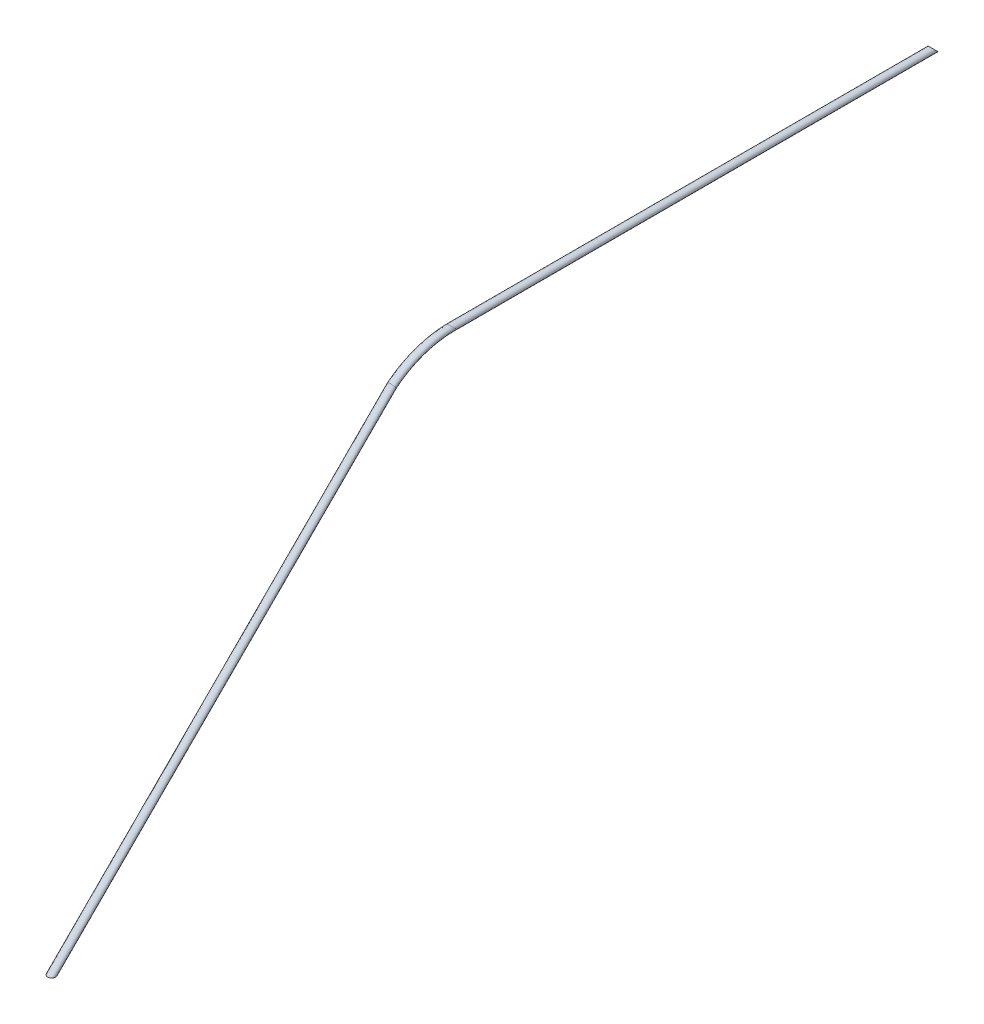
ISO-10303-21;
HEADER;
FILE_DESCRIPTION(('STEP AP214'),'2;1');
FILE_NAME('part.step','',(''),(''),'','','');
FILE_SCHEMA(('AUTOMOTIVE_DESIGN { 1 0 10303 214 1 1 1 1 }'));
ENDSEC;
DATA;
#1=APPLICATION_CONTEXT('core data for automotive mechanical design processes');
#2=APPLICATION_PROTOCOL_DEFINITION('international standard','automotive_design',2000,#1);
#3=PRODUCT_CONTEXT('',#1,'mechanical');
#4=PRODUCT('Part','Part','',(#3));
#5=PRODUCT_RELATED_PRODUCT_CATEGORY('part','',(#4));
#6=PRODUCT_DEFINITION_FORMATION('','',#4);
#7=PRODUCT_DEFINITION_CONTEXT('part definition',#1,'design');
#8=PRODUCT_DEFINITION('design','',#6,#7);
#9=PRODUCT_DEFINITION_SHAPE('','',#8);
#10=(LENGTH_UNIT() NAMED_UNIT(*) SI_UNIT(.MILLI.,.METRE.));
#11=(NAMED_UNIT(*) PLANE_ANGLE_UNIT() SI_UNIT($,.RADIAN.));
#12=(NAMED_UNIT(*) SI_UNIT($,.STERADIAN.) SOLID_ANGLE_UNIT());
#13=UNCERTAINTY_MEASURE_WITH_UNIT(LENGTH_MEASURE(1.E-05),#10,'distance_accuracy_value','');
#14=(GEOMETRIC_REPRESENTATION_CONTEXT(3) GLOBAL_UNCERTAINTY_ASSIGNED_CONTEXT((#13)) GLOBAL_UNIT_ASSIGNED_CONTEXT((#10,
#11,#12)) REPRESENTATION_CONTEXT('',''));
#15=CARTESIAN_POINT('',(0.,0.,0.));
#16=DIRECTION('',(0.,0.,1.));
#17=DIRECTION('',(1.,0.,0.));
#18=AXIS2_PLACEMENT_3D('',#15,#16,#17);
#19=CARTESIAN_POINT('',(0.,112.564494546636,-274.712154418931));
#20=DIRECTION('',(0.,0.707106781186546,-0.707106781186549));
#21=DIRECTION('',(0.,0.707106781186549,0.707106781186546));
#22=AXIS2_PLACEMENT_3D('',#19,#20,#21);
#23=PLANE('',#22);
#24=CARTESIAN_POINT('',(0.,112.564494546636,-274.712154418931));
#25=DIRECTION('',(0.,0.707106781186546,-0.707106781186549));
#26=DIRECTION('',(0.,0.707106781186549,0.707106781186546));
#27=AXIS2_PLACEMENT_3D('',#24,#25,#26);
#28=CIRCLE('',#27,1.25);
#29=CARTESIAN_POINT('',(0.,113.448378023119,-273.828270942448));
#30=VERTEX_POINT('',#29);
#31=EDGE_CURVE('E38',#30,#30,#28,.T.);
#32=ORIENTED_EDGE('',*,*,#31,.T.);
#33=EDGE_LOOP('',(#32));
#34=FACE_BOUND('',#33,.T.);
#35=ADVANCED_FACE('F35',(#34),#23,.T.);
#36=CARTESIAN_POINT('',(0.,0.,0.));
#37=DIRECTION('',(0.,1.,0.));
#38=DIRECTION('',(0.,0.,1.));
#39=AXIS2_PLACEMENT_3D('',#36,#37,#38);
#40=PLANE('',#39);
#41=CARTESIAN_POINT('',(0.,0.,0.));
#42=DIRECTION('',(0.,1.,0.));
#43=DIRECTION('',(0.,0.,1.));
#44=AXIS2_PLACEMENT_3D('',#41,#42,#43);
#45=CIRCLE('',#44,1.25);
#46=CARTESIAN_POINT('',(0.,0.,1.25));
#47=VERTEX_POINT('',#46);
#48=EDGE_CURVE('E55',#47,#47,#45,.T.);
#49=ORIENTED_EDGE('',*,*,#48,.F.);
#50=EDGE_LOOP('',(#49));
#51=FACE_BOUND('',#50,.T.);
#52=ADVANCED_FACE('F111',(#51),#40,.F.);
#53=CARTESIAN_POINT('',(0.,105.577305752246,-104.027956080632));
#54=CARTESIAN_POINT('',(0.,105.787893948815,-104.293380667153));
#55=CARTESIAN_POINT('',(0.,105.99147204465,-104.557995570937));
#56=CARTESIAN_POINT('',(0.,106.747553293268,-105.483070542752));
#57=CARTESIAN_POINT('',(0.,107.292985696413,-106.169156479261));
#58=CARTESIAN_POINT('',(0.,108.290000005037,-107.5791623847));
#59=CARTESIAN_POINT('',(0.,108.758934755658,-108.305072615006));
#60=CARTESIAN_POINT('',(0.,110.072077272006,-110.537864610288));
#61=CARTESIAN_POINT('',(0.,110.822354029564,-112.099820584772));
#62=CARTESIAN_POINT('',(0.,112.05182056666,-115.327316035152));
#63=CARTESIAN_POINT('',(0.,112.530927374933,-116.992656518133));
#64=CARTESIAN_POINT('',(0.,113.036127258252,-119.533287032788));
#65=CARTESIAN_POINT('',(0.,113.169003969863,-120.387223912541));
#66=CARTESIAN_POINT('',(0.,113.362778050406,-122.103178730383));
#67=CARTESIAN_POINT('',(0.,113.436027513086,-122.97754001041));
#68=CARTESIAN_POINT('',(0.,113.448378023119,-123.828270942448));
#69=CARTESIAN_POINT('',(2.49999999999999,105.577305752246,-104.027956080632));
#70=CARTESIAN_POINT('',(2.49999999999999,105.787893948815,-104.293380667153));
#71=CARTESIAN_POINT('',(2.49999999999999,105.99147204465,-104.557995570937));
#72=CARTESIAN_POINT('',(2.49999999999999,106.747553293268,-105.483070542752));
#73=CARTESIAN_POINT('',(2.49999999999999,107.292985696413,-106.169156479261));
#74=CARTESIAN_POINT('',(2.49999999999999,108.290000005037,-107.5791623847));
#75=CARTESIAN_POINT('',(2.49999999999999,108.758934755658,-108.305072615006));
#76=CARTESIAN_POINT('',(2.49999999999999,110.072077272006,-110.537864610288));
#77=CARTESIAN_POINT('',(2.49999999999999,110.822354029564,-112.099820584772));
#78=CARTESIAN_POINT('',(2.49999999999999,112.05182056666,-115.327316035152));
#79=CARTESIAN_POINT('',(2.49999999999999,112.530927374933,-116.992656518133));
#80=CARTESIAN_POINT('',(2.49999999999999,113.036127258252,-119.533287032788));
#81=CARTESIAN_POINT('',(2.49999999999999,113.169003969863,-120.387223912541));
#82=CARTESIAN_POINT('',(2.49999999999999,113.362778050406,-122.103178730383));
#83=CARTESIAN_POINT('',(2.49999999999999,113.436027513086,-122.97754001041));
#84=CARTESIAN_POINT('',(2.49999999999999,113.448378023119,-123.828270942448));
#85=CARTESIAN_POINT('',(2.49999999999999,105.291199424344,-106.511530756202));
#86=CARTESIAN_POINT('',(2.49999999999999,105.501787620913,-106.776955342724));
#87=CARTESIAN_POINT('',(2.49999999999999,105.71939035038,-107.043186112822));
#88=CARTESIAN_POINT('',(2.49999999999999,106.426740691447,-107.962646490056));
#89=CARTESIAN_POINT('',(2.49999999999999,106.868395547251,-108.633827745709));
#90=CARTESIAN_POINT('',(2.49999999999999,107.728422836529,-110.016273857374));
#91=CARTESIAN_POINT('',(2.49999999999999,108.129442282032,-110.725531325174));
#92=CARTESIAN_POINT('',(2.49999999999999,109.241289962979,-112.8999224028));
#93=CARTESIAN_POINT('',(2.49999999999999,109.860653394342,-114.411671873198));
#94=CARTESIAN_POINT('',(2.49999999999999,110.838486455123,-117.517600223407));
#95=CARTESIAN_POINT('',(2.49999999999999,111.196889049572,-119.111587207401));
#96=CARTESIAN_POINT('',(2.49999999999999,111.531222531544,-121.530821298671));
#97=CARTESIAN_POINT('',(2.49999999999999,111.608841353382,-122.341903856913));
#98=CARTESIAN_POINT('',(2.49999999999999,111.695885188338,-123.967675783528));
#99=CARTESIAN_POINT('',(2.49999999999999,111.692961580186,-124.770007983444));
#100=CARTESIAN_POINT('',(2.49999999999999,111.680611070153,-125.596037895415));
#101=CARTESIAN_POINT('',(0.,105.291199424344,-106.511530756202));
#102=CARTESIAN_POINT('',(0.,105.501787620913,-106.776955342724));
#103=CARTESIAN_POINT('',(0.,105.71939035038,-107.043186112822));
#104=CARTESIAN_POINT('',(0.,106.426740691447,-107.962646490056));
#105=CARTESIAN_POINT('',(0.,106.868395547251,-108.633827745712));
#106=CARTESIAN_POINT('',(0.,107.728422836529,-110.016273857371));
#107=CARTESIAN_POINT('',(0.,108.129442282032,-110.725531325174));
#108=CARTESIAN_POINT('',(0.,109.241289962979,-112.8999224028));
#109=CARTESIAN_POINT('',(0.,109.860653394342,-114.411671873198));
#110=CARTESIAN_POINT('',(0.,110.838486455123,-117.517600223407));
#111=CARTESIAN_POINT('',(0.,111.196889049572,-119.111587207401));
#112=CARTESIAN_POINT('',(0.,111.531222531544,-121.530821298671));
#113=CARTESIAN_POINT('',(0.,111.608841353382,-122.341903856913));
#114=CARTESIAN_POINT('',(0.,111.695885188338,-123.967675783528));
#115=CARTESIAN_POINT('',(0.,111.692961580186,-124.770007983444));
#116=CARTESIAN_POINT('',(0.,111.680611070153,-125.596037895415));
#117=CARTESIAN_POINT('',(-2.50000000000001,105.291199424344,-106.511530756202));
#118=CARTESIAN_POINT('',(-2.50000000000001,105.501787620913,-106.776955342724));
#119=CARTESIAN_POINT('',(-2.50000000000001,105.71939035038,-107.043186112822));
#120=CARTESIAN_POINT('',(-2.50000000000001,106.426740691447,-107.962646490056));
#121=CARTESIAN_POINT('',(-2.50000000000001,106.868395547251,-108.633827745715));
#122=CARTESIAN_POINT('',(-2.50000000000001,107.728422836529,-110.016273857368));
#123=CARTESIAN_POINT('',(-2.50000000000001,108.129442282032,-110.725531325174));
#124=CARTESIAN_POINT('',(-2.50000000000001,109.241289962979,-112.8999224028));
#125=CARTESIAN_POINT('',(-2.50000000000001,109.860653394342,-114.411671873198));
#126=CARTESIAN_POINT('',(-2.50000000000001,110.838486455123,-117.517600223407));
#127=CARTESIAN_POINT('',(-2.50000000000001,111.196889049572,-119.111587207401));
#128=CARTESIAN_POINT('',(-2.50000000000001,111.531222531544,-121.530821298671));
#129=CARTESIAN_POINT('',(-2.50000000000001,111.608841353382,-122.341903856913));
#130=CARTESIAN_POINT('',(-2.50000000000001,111.695885188338,-123.967675783528));
#131=CARTESIAN_POINT('',(-2.50000000000001,111.692961580186,-124.770007983444));
#132=CARTESIAN_POINT('',(-2.50000000000001,111.680611070153,-125.596037895415));
#133=CARTESIAN_POINT('',(-2.50000000000001,105.577305752246,-104.027956080632));
#134=CARTESIAN_POINT('',(-2.50000000000001,105.787893948815,-104.293380667153));
#135=CARTESIAN_POINT('',(-2.50000000000001,105.99147204465,-104.557995570937));
#136=CARTESIAN_POINT('',(-2.50000000000001,106.747553293268,-105.483070542752));
#137=CARTESIAN_POINT('',(-2.50000000000001,107.292985696413,-106.169156479261));
#138=CARTESIAN_POINT('',(-2.50000000000001,108.290000005037,-107.5791623847));
#139=CARTESIAN_POINT('',(-2.50000000000001,108.758934755658,-108.305072615006));
#140=CARTESIAN_POINT('',(-2.50000000000001,110.072077272006,-110.537864610288));
#141=CARTESIAN_POINT('',(-2.50000000000001,110.822354029564,-112.099820584772));
#142=CARTESIAN_POINT('',(-2.50000000000001,112.05182056666,-115.327316035152));
#143=CARTESIAN_POINT('',(-2.50000000000001,112.530927374933,-116.992656518133));
#144=CARTESIAN_POINT('',(-2.50000000000001,113.036127258252,-119.533287032788));
#145=CARTESIAN_POINT('',(-2.50000000000001,113.169003969863,-120.387223912541));
#146=CARTESIAN_POINT('',(-2.50000000000001,113.362778050406,-122.103178730383));
#147=CARTESIAN_POINT('',(-2.50000000000001,113.436027513086,-122.97754001041));
#148=CARTESIAN_POINT('',(-2.50000000000001,113.448378023119,-123.828270942448));
#149=CARTESIAN_POINT('',(0.,105.577305752246,-104.027956080632));
#150=CARTESIAN_POINT('',(0.,105.787893948815,-104.293380667153));
#151=CARTESIAN_POINT('',(0.,105.99147204465,-104.557995570937));
#152=CARTESIAN_POINT('',(0.,106.747553293268,-105.483070542752));
#153=CARTESIAN_POINT('',(0.,107.292985696413,-106.169156479261));
#154=CARTESIAN_POINT('',(0.,108.290000005037,-107.5791623847));
#155=CARTESIAN_POINT('',(0.,108.758934755658,-108.305072615006));
#156=CARTESIAN_POINT('',(0.,110.072077272006,-110.537864610288));
#157=CARTESIAN_POINT('',(0.,110.822354029564,-112.099820584772));
#158=CARTESIAN_POINT('',(0.,112.05182056666,-115.327316035152));
#159=CARTESIAN_POINT('',(0.,112.530927374933,-116.992656518133));
#160=CARTESIAN_POINT('',(0.,113.036127258252,-119.533287032788));
#161=CARTESIAN_POINT('',(0.,113.169003969863,-120.387223912541));
#162=CARTESIAN_POINT('',(0.,113.362778050406,-122.103178730383));
#163=CARTESIAN_POINT('',(0.,113.436027513086,-122.97754001041));
#164=CARTESIAN_POINT('',(0.,113.448378023119,-123.828270942448));
#165=(BOUNDED_SURFACE() B_SPLINE_SURFACE(3,3,((#53,#54,#55,#56,#57,#58,#59,#60,#61,#62,#63,#64,
#65,#66,#67,#68),(#69,#70,#71,#72,#73,#74,#75,#76,#77,#78,#79,#80,#81,#82,#83,#84),(#85,#86,#87,
#88,#89,#90,#91,#92,#93,#94,#95,#96,#97,#98,#99,#100),(#101,#102,#103,#104,#105,#106,#107,#108,
#109,#110,#111,#112,#113,#114,#115,#116),(#117,#118,#119,#120,#121,#122,#123,#124,#125,#126,
#127,#128,#129,#130,#131,#132),(#133,#134,#135,#136,#137,#138,#139,#140,#141,#142,#143,#144,
#145,#146,#147,#148),(#149,#150,#151,#152,#153,#154,#155,#156,#157,#158,#159,#160,#161,#162,
#163,#164)),.UNSPECIFIED.,.T.,.F.,.F.) B_SPLINE_SURFACE_WITH_KNOTS((4,3,4),(4,2,2,2,2,2,2,4),
(0.,0.5,1.),(-0.00597430868744102,0.,0.014784414282452,0.029568828564904,0.0591376571298081,
0.0887064856947122,0.103490899977164,0.118275314259616),
.UNSPECIFIED.) GEOMETRIC_REPRESENTATION_ITEM() RATIONAL_B_SPLINE_SURFACE(((1.,1.,1.,1.,1.,1.,1.,
1.,1.,1.,1.,1.,1.,1.,1.,1.),(0.333333333333333,0.333333333333333,0.333333333333333,
0.333333333333333,0.333333333333333,0.333333333333333,0.333333333333333,0.333333333333333,
0.333333333333333,0.333333333333333,0.333333333333333,0.333333333333333,0.333333333333333,
0.333333333333333,0.333333333333333,0.333333333333333),(0.333333333333333,0.333333333333333,
0.333333333333333,0.333333333333333,0.333333333333333,0.333333333333333,0.333333333333333,
0.333333333333333,0.333333333333333,0.333333333333333,0.333333333333333,0.333333333333333,
0.333333333333333,0.333333333333333,0.333333333333333,0.333333333333333),(1.,1.,1.,1.,1.,1.,1.,
1.,1.,1.,1.,1.,1.,1.,1.,1.),(0.333333333333333,0.333333333333333,0.333333333333333,
0.333333333333333,0.333333333333333,0.333333333333333,0.333333333333333,0.333333333333333,
0.333333333333333,0.333333333333333,0.333333333333333,0.333333333333333,0.333333333333333,
0.333333333333333,0.333333333333333,0.333333333333333),(0.333333333333333,0.333333333333333,
0.333333333333333,0.333333333333333,0.333333333333333,0.333333333333333,0.333333333333333,
0.333333333333333,0.333333333333333,0.333333333333333,0.333333333333333,0.333333333333333,
0.333333333333333,0.333333333333333,0.333333333333333,0.333333333333333),(1.,1.,1.,1.,1.,1.,1.,
1.,1.,1.,1.,1.,1.,1.,1.,1.))) REPRESENTATION_ITEM('') SURFACE());
#166=CARTESIAN_POINT('',(-1.25,106.066017177982,-106.066017177982));
#167=CARTESIAN_POINT('',(-1.25000068228441,106.069693942708,-106.062739105642));
#168=CARTESIAN_POINT('',(-1.24994248982881,106.073372109985,-106.059460668479));
#169=CARTESIAN_POINT('',(-1.24893383862452,106.105170774795,-106.031128567723));
#170=CARTESIAN_POINT('',(-1.24462391313585,106.133316882298,-106.006123824481));
#171=CARTESIAN_POINT('',(-1.2294874359396,106.188886804817,-105.957230148748));
#172=CARTESIAN_POINT('',(-1.21864207714343,106.21630829596,-105.93334465174));
#173=CARTESIAN_POINT('',(-1.19129928186287,106.269601816085,-105.887597216591));
#174=CARTESIAN_POINT('',(-1.17484006497869,106.295482967733,-105.865722832851));
#175=CARTESIAN_POINT('',(-1.13720232454529,106.345477133763,-105.824206255764));
#176=CARTESIAN_POINT('',(-1.11602455843647,106.369590431104,-105.804563704918));
#177=CARTESIAN_POINT('',(-1.05890668864403,106.426790800205,-105.758861849717));
#178=CARTESIAN_POINT('',(-1.02072239494722,106.45872679608,-105.73416275651));
#179=CARTESIAN_POINT('',(-0.938414192877257,106.518014647848,-105.689586761629));
#180=CARTESIAN_POINT('',(-0.894275193352298,106.545354446618,-105.669722483818));
#181=CARTESIAN_POINT('',(-0.784236681129349,106.604850253706,-105.627600486749));
#182=CARTESIAN_POINT('',(-0.716443635115712,106.634886130828,-105.607303590466));
#183=CARTESIAN_POINT('',(-0.576032438552517,106.686038806916,-105.57364340115));
#184=CARTESIAN_POINT('',(-0.503410712205633,106.707148908972,-105.560285312515));
#185=CARTESIAN_POINT('',(-0.353415527578786,106.740957407285,-105.539235731693));
#186=CARTESIAN_POINT('',(-0.275967320005585,106.753419866993,-105.531702582244));
#187=CARTESIAN_POINT('',(-0.119802285531962,106.769052851831,-105.522295623776));
#188=CARTESIAN_POINT('',(-0.0410849900800618,106.772219862216,-105.520423955436));
#189=CARTESIAN_POINT('',(0.131741318958194,106.768967877185,-105.522358924111));
#190=CARTESIAN_POINT('',(0.225807261811382,106.760523538852,-105.527365110429));
#191=CARTESIAN_POINT('',(0.410966939658261,106.730240836748,-105.54585534265));
#192=CARTESIAN_POINT('',(0.502061828841223,106.708407741092,-105.559336054109));
#193=CARTESIAN_POINT('',(0.652380106930133,106.659560710173,-105.590954731827));
#194=CARTESIAN_POINT('',(0.713209282332022,106.635864766508,-105.606622782362));
#195=CARTESIAN_POINT('',(0.829807275221866,106.581632192475,-105.643871395417));
#196=CARTESIAN_POINT('',(0.885584964778129,106.551107895631,-105.66544131333));
#197=CARTESIAN_POINT('',(0.975718650369812,106.492254349197,-105.708795281097));
#198=CARTESIAN_POINT('',(1.01183854773685,106.46547985121,-105.72901377771));
#199=CARTESIAN_POINT('',(1.07842779152646,106.408381973311,-105.773430291025));
#200=CARTESIAN_POINT('',(1.1089038555293,106.378062883425,-105.797623511202));
#201=CARTESIAN_POINT('',(1.15702891747683,106.320577056287,-105.844746319932));
#202=CARTESIAN_POINT('',(1.17602252404707,106.293970587858,-105.86698157798));
#203=CARTESIAN_POINT('',(1.20804172273968,106.239130517686,-105.913631841713));
#204=CARTESIAN_POINT('',(1.22107736040476,106.210899745816,-105.93804309483));
#205=CARTESIAN_POINT('',(1.23643319985141,106.164905388611,-105.978297376996));
#206=CARTESIAN_POINT('',(1.24095331868757,106.147450255733,-105.993681433745));
#207=CARTESIAN_POINT('',(1.24736923380114,106.112346212346,-106.024762838653));
#208=CARTESIAN_POINT('',(1.24926748123919,106.094697498396,-106.040459880255));
#209=CARTESIAN_POINT('',(1.24994218017834,106.073372468017,-106.05946039302));
#210=CARTESIAN_POINT('',(1.25000034108101,106.069694297098,-106.062738839563));
#211=CARTESIAN_POINT('',(1.25,106.066017177982,-106.066017177982));
#212=B_SPLINE_CURVE_WITH_KNOTS('',3,(#166,#167,#168,#169,#170,#171,#172,#173,#174,#175,#176,
#177,#178,#179,#180,#181,#182,#183,#184,#185,#186,#187,#188,#189,#190,#191,#192,#193,#194,#195,
#196,#197,#198,#199,#200,#201,#202,#203,#204,#205,#206,#207,#208,#209,#210,#211),.UNSPECIFIED.,
.F.,.F.,(4,2,2,2,2,2,2,2,2,2,2,2,2,2,2,2,2,2,2,2,2,2,4),(0.,0.01478103128423,0.12777017755033,
0.241086037122799,0.353645342096297,0.466186591600664,0.631966579842615,0.79817489005356,
1.02756759081163,1.25713209825222,1.4927367327191,1.72843044121327,2.01086008089157,
2.29317866335719,2.4939514822234,2.69436454748249,2.84177045184424,2.98899976235201,
3.10714753896764,3.22509536875264,3.29607516064768,3.36698854924552,3.3817695805298),.UNSPECIFIED.);
#213=CARTESIAN_POINT('',(1.25,106.066017177982,-106.066017177982));
#214=VERTEX_POINT('',#213);
#215=CARTESIAN_POINT('',(-1.25,106.066017177982,-106.066017177982));
#216=VERTEX_POINT('',#215);
#217=EDGE_CURVE('E44',#214,#216,#212,.F.);
#218=CARTESIAN_POINT('',(-1.25,106.066017177982,-106.066017177982));
#219=CARTESIAN_POINT('',(-1.25000070711569,106.062340420373,-106.069295307129));
#220=CARTESIAN_POINT('',(-1.24994250800944,106.058669231533,-106.072581579407));
#221=CARTESIAN_POINT('',(-1.24893689672692,106.027100126864,-106.100944971203));
#222=CARTESIAN_POINT('',(-1.24465418322186,105.999555798538,-106.126395006139));
#223=CARTESIAN_POINT('',(-1.22959649624973,105.945670084108,-106.17671866006));
#224=CARTESIAN_POINT('',(-1.21880231231831,105.919332506573,-106.201590346397));
#225=CARTESIAN_POINT('',(-1.19156891339899,105.868453492559,-106.249604033612));
#226=CARTESIAN_POINT('',(-1.17516848883536,105.843901083741,-106.272756623476));
#227=CARTESIAN_POINT('',(-1.13764233029865,105.7966716592,-106.316976860887));
#228=CARTESIAN_POINT('',(-1.11651746894195,105.773994298209,-106.338044892422));
#229=CARTESIAN_POINT('',(-1.05965092169713,105.720512699324,-106.387227559713));
#230=CARTESIAN_POINT('',(-1.02169135107279,105.690861629078,-106.4140356062));
#231=CARTESIAN_POINT('',(-0.939861554454597,105.63608297083,-106.462847794267));
#232=CARTESIAN_POINT('',(-0.895977030909607,105.610966679469,-106.484839967173));
#233=CARTESIAN_POINT('',(-0.786404644281596,105.556526914629,-106.53202419488));
#234=CARTESIAN_POINT('',(-0.718815214997919,105.529291278826,-106.555202264677));
#235=CARTESIAN_POINT('',(-0.578865144412656,105.483260896216,-106.594175993653));
#236=CARTESIAN_POINT('',(-0.506498572055235,105.464476877433,-106.60996227112));
#237=CARTESIAN_POINT('',(-0.339771317831642,105.431042302702,-106.638055250464));
#238=CARTESIAN_POINT('',(-0.244600879193216,105.418751069657,-106.648377646875));
#239=CARTESIAN_POINT('',(-0.0528599650961696,105.406257805642,-106.658871559641));
#240=CARTESIAN_POINT('',(0.0437121382841031,105.40607118311,-106.659030138066));
#241=CARTESIAN_POINT('',(0.236256503201829,105.417832645641,-106.649147841798));
#242=CARTESIAN_POINT('',(0.332220499670718,105.42986146993,-106.639039104169));
#243=CARTESIAN_POINT('',(0.519790268433016,105.466832960886,-106.607990990153));
#244=CARTESIAN_POINT('',(0.611405770792922,105.491745153167,-106.587077172273));
#245=CARTESIAN_POINT('',(0.752804982893248,105.543254916743,-106.543279926754));
#246=CARTESIAN_POINT('',(0.805297022087977,105.565645624439,-106.52413813182));
#247=CARTESIAN_POINT('',(0.905260636335408,105.61587630164,-106.4805657729));
#248=CARTESIAN_POINT('',(0.952739974531347,105.643707648789,-106.456143570923));
#249=CARTESIAN_POINT('',(1.03029093238045,105.697764704738,-106.407782742731));
#250=CARTESIAN_POINT('',(1.06185631376898,105.722891596084,-106.385020830185));
#251=CARTESIAN_POINT('',(1.11918784531988,105.776231259122,-106.336004802586));
#252=CARTESIAN_POINT('',(1.14495947812469,105.804441075534,-106.309754026815));
#253=CARTESIAN_POINT('',(1.18504165673439,105.858303450114,-106.259200157407));
#254=CARTESIAN_POINT('',(1.20057933399087,105.88350530291,-106.235394057279));
#255=CARTESIAN_POINT('',(1.22564572377115,105.93543717432,-106.186401647791));
#256=CARTESIAN_POINT('',(1.23518821608193,105.962163533379,-106.161218649225));
#257=CARTESIAN_POINT('',(1.24629543914772,106.01099693646,-106.115857750691));
#258=CARTESIAN_POINT('',(1.24912274347898,106.03288180247,-106.09575083393));
#259=CARTESIAN_POINT('',(1.24994221979997,106.058668897493,-106.07258180781));
#260=CARTESIAN_POINT('',(1.25000038469767,106.062340065019,-106.069295542547));
#261=CARTESIAN_POINT('',(1.25,106.066017177982,-106.066017177982));
#262=B_SPLINE_CURVE_WITH_KNOTS('',3,(#218,#219,#220,#221,#222,#223,#224,#225,#226,#227,#228,
#229,#230,#231,#232,#233,#234,#235,#236,#237,#238,#239,#240,#241,#242,#243,#244,#245,#246,#247,
#248,#249,#250,#251,#252,#253,#254,#255,#256,#257,#258,#259,#260,#261),.UNSPECIFIED.,.F.,.F.,(4,
2,2,2,2,2,2,2,2,2,2,2,2,2,2,2,2,2,2,2,2,4),(0.,0.0147810599924308,0.127319810278406,
0.240192212966385,0.352298932997435,0.464384963687258,0.628838656323211,0.793696533126418,
1.02185817043537,1.25030861230459,1.53839941738527,1.82685693748479,2.11723353590492,
2.40692639650453,2.58697091937269,2.7667323866244,2.9052156301234,3.04356726964809,
3.1570700671535,3.27031101751417,3.35954010768182,3.37432116767426),.UNSPECIFIED.);
#263=EDGE_CURVE('E11',#214,#216,#262,.F.);
#264=CARTESIAN_POINT('',(0.,112.564494546636,-124.712154418931));
#265=DIRECTION('',(0.,0.707106781186541,-0.707106781186554));
#266=DIRECTION('',(0.,0.707106781186554,0.707106781186541));
#267=AXIS2_PLACEMENT_3D('',#264,#265,#266);
#268=CIRCLE('',#267,1.25);
#269=CARTESIAN_POINT('',(0.,113.448378023119,-123.828270942448));
#270=VERTEX_POINT('',#269);
#271=EDGE_CURVE('E69',#270,#270,#268,.T.);
#272=ORIENTED_EDGE('',*,*,#217,.F.);
#273=ORIENTED_EDGE('',*,*,#263,.T.);
#274=EDGE_LOOP('',(#272,#273));
#275=FACE_BOUND('',#274,.T.);
#276=ORIENTED_EDGE('',*,*,#271,.F.);
#277=EDGE_LOOP('',(#276));
#278=FACE_BOUND('',#277,.T.);
#279=ADVANCED_FACE('F51',(#275,#278),#165,.T.);
#280=CARTESIAN_POINT('',(0.,113.448378023119,-123.828270942448));
#281=CARTESIAN_POINT('',(0.,113.448378023119,-273.828270942448));
#282=CARTESIAN_POINT('',(2.49999999999999,113.448378023119,-123.828270942448));
#283=CARTESIAN_POINT('',(2.49999999999999,113.448378023119,-273.828270942448));
#284=CARTESIAN_POINT('',(2.49999999999999,111.680611070153,-125.596037895415));
#285=CARTESIAN_POINT('',(2.49999999999999,111.680611070153,-275.596037895414));
#286=CARTESIAN_POINT('',(0.,111.680611070153,-125.596037895415));
#287=CARTESIAN_POINT('',(0.,111.680611070153,-275.596037895415));
#288=CARTESIAN_POINT('',(-2.50000000000001,111.680611070153,-125.596037895415));
#289=CARTESIAN_POINT('',(-2.50000000000001,111.680611070153,-275.596037895414));
#290=CARTESIAN_POINT('',(-2.50000000000001,113.448378023119,-123.828270942448));
#291=CARTESIAN_POINT('',(-2.50000000000001,113.448378023119,-273.828270942448));
#292=CARTESIAN_POINT('',(0.,113.448378023119,-123.828270942448));
#293=CARTESIAN_POINT('',(0.,113.448378023119,-273.828270942448));
#294=(BOUNDED_SURFACE() B_SPLINE_SURFACE(3,1,((#280,#281),(#282,#283),(#284,#285),(#286,#287),
(#288,#289),(#290,#291),(#292,#293)),.UNSPECIFIED.,.T.,.F.,.F.) B_SPLINE_SURFACE_WITH_KNOTS((4,
3,4),(2,2),(0.,0.5,1.),(0.,1.),
.UNSPECIFIED.) GEOMETRIC_REPRESENTATION_ITEM() RATIONAL_B_SPLINE_SURFACE(((1.,1.),
(0.333333333333333,0.333333333333333),(0.333333333333333,0.333333333333333),(1.,1.),
(0.333333333333333,0.333333333333333),(0.333333333333333,0.333333333333333),(1.,1.))) REPRESENTATION_ITEM('') SURFACE());
#295=CARTESIAN_POINT('',(0.,113.448378023119,-273.828270942448));
#296=CARTESIAN_POINT('',(0.,113.448378023119,-272.265770942448));
#297=CARTESIAN_POINT('',(0.,113.448378023119,-270.703270942448));
#298=CARTESIAN_POINT('',(0.,113.448378023119,-267.578270942448));
#299=CARTESIAN_POINT('',(0.,113.448378023119,-266.015770942448));
#300=CARTESIAN_POINT('',(0.,113.448378023119,-262.890770942448));
#301=CARTESIAN_POINT('',(0.,113.448378023119,-261.328270942448));
#302=CARTESIAN_POINT('',(0.,113.448378023119,-258.203270942448));
#303=CARTESIAN_POINT('',(0.,113.448378023119,-256.640770942448));
#304=CARTESIAN_POINT('',(0.,113.448378023119,-253.515770942448));
#305=CARTESIAN_POINT('',(0.,113.448378023119,-251.953270942448));
#306=CARTESIAN_POINT('',(0.,113.448378023119,-248.828270942448));
#307=CARTESIAN_POINT('',(0.,113.448378023119,-247.265770942448));
#308=CARTESIAN_POINT('',(0.,113.448378023119,-244.140770942448));
#309=CARTESIAN_POINT('',(0.,113.448378023119,-242.578270942448));
#310=CARTESIAN_POINT('',(0.,113.448378023119,-239.453270942448));
#311=CARTESIAN_POINT('',(0.,113.448378023119,-237.890770942448));
#312=CARTESIAN_POINT('',(0.,113.448378023119,-234.765770942448));
#313=CARTESIAN_POINT('',(0.,113.448378023119,-233.203270942448));
#314=CARTESIAN_POINT('',(0.,113.448378023119,-230.078270942448));
#315=CARTESIAN_POINT('',(0.,113.448378023119,-228.515770942448));
#316=CARTESIAN_POINT('',(0.,113.448378023119,-225.390770942448));
#317=CARTESIAN_POINT('',(0.,113.448378023119,-223.828270942448));
#318=CARTESIAN_POINT('',(0.,113.448378023119,-220.703270942448));
#319=CARTESIAN_POINT('',(0.,113.448378023119,-219.140770942448));
#320=CARTESIAN_POINT('',(0.,113.448378023119,-216.015770942448));
#321=CARTESIAN_POINT('',(0.,113.448378023119,-214.453270942448));
#322=CARTESIAN_POINT('',(0.,113.448378023119,-211.328270942448));
#323=CARTESIAN_POINT('',(0.,113.448378023119,-209.765770942448));
#324=CARTESIAN_POINT('',(0.,113.448378023119,-206.640770942448));
#325=CARTESIAN_POINT('',(0.,113.448378023119,-205.078270942448));
#326=CARTESIAN_POINT('',(0.,113.448378023119,-201.953270942448));
#327=CARTESIAN_POINT('',(0.,113.448378023119,-200.390770942448));
#328=CARTESIAN_POINT('',(0.,113.448378023119,-197.265770942448));
#329=CARTESIAN_POINT('',(0.,113.448378023119,-195.703270942448));
#330=CARTESIAN_POINT('',(0.,113.448378023119,-192.578270942448));
#331=CARTESIAN_POINT('',(0.,113.448378023119,-191.015770942448));
#332=CARTESIAN_POINT('',(0.,113.448378023119,-187.890770942448));
#333=CARTESIAN_POINT('',(0.,113.448378023119,-186.328270942448));
#334=CARTESIAN_POINT('',(0.,113.448378023119,-183.203270942448));
#335=CARTESIAN_POINT('',(0.,113.448378023119,-181.640770942448));
#336=CARTESIAN_POINT('',(0.,113.448378023119,-178.515770942448));
#337=CARTESIAN_POINT('',(0.,113.448378023119,-176.953270942448));
#338=CARTESIAN_POINT('',(0.,113.448378023119,-173.828270942448));
#339=CARTESIAN_POINT('',(0.,113.448378023119,-172.265770942448));
#340=CARTESIAN_POINT('',(0.,113.448378023119,-169.140770942448));
#341=CARTESIAN_POINT('',(0.,113.448378023119,-167.578270942448));
#342=CARTESIAN_POINT('',(0.,113.448378023119,-164.453270942448));
#343=CARTESIAN_POINT('',(0.,113.448378023119,-162.890770942448));
#344=CARTESIAN_POINT('',(0.,113.448378023119,-159.765770942448));
#345=CARTESIAN_POINT('',(0.,113.448378023119,-158.203270942448));
#346=CARTESIAN_POINT('',(0.,113.448378023119,-155.078270942448));
#347=CARTESIAN_POINT('',(0.,113.448378023119,-153.515770942448));
#348=CARTESIAN_POINT('',(0.,113.448378023119,-150.390770942448));
#349=CARTESIAN_POINT('',(0.,113.448378023119,-148.828270942448));
#350=CARTESIAN_POINT('',(0.,113.448378023119,-145.703270942448));
#351=CARTESIAN_POINT('',(0.,113.448378023119,-144.140770942448));
#352=CARTESIAN_POINT('',(0.,113.448378023119,-141.015770942448));
#353=CARTESIAN_POINT('',(0.,113.448378023119,-139.453270942448));
#354=CARTESIAN_POINT('',(0.,113.448378023119,-136.328270942448));
#355=CARTESIAN_POINT('',(0.,113.448378023119,-134.765770942448));
#356=CARTESIAN_POINT('',(0.,113.448378023119,-131.640770942448));
#357=CARTESIAN_POINT('',(0.,113.448378023119,-130.078270942448));
#358=CARTESIAN_POINT('',(0.,113.448378023119,-126.953270942448));
#359=CARTESIAN_POINT('',(0.,113.448378023119,-125.390770942448));
#360=CARTESIAN_POINT('',(0.,113.448378023119,-123.828270942448));
#361=B_SPLINE_CURVE_WITH_KNOTS('',3,(#295,#296,#297,#298,#299,#300,#301,#302,#303,#304,#305,
#306,#307,#308,#309,#310,#311,#312,#313,#314,#315,#316,#317,#318,#319,#320,#321,#322,#323,#324,
#325,#326,#327,#328,#329,#330,#331,#332,#333,#334,#335,#336,#337,#338,#339,#340,#341,#342,#343,
#344,#345,#346,#347,#348,#349,#350,#351,#352,#353,#354,#355,#356,#357,#358,#359,#360),
.UNSPECIFIED.,.F.,.F.,(4,2,2,2,2,2,2,2,2,2,2,2,2,2,2,2,2,2,2,2,2,2,2,2,2,2,2,2,2,2,2,2,4),(0.,
4.68750000000001,9.37499999999997,14.0625,18.75,23.4375,28.125,32.8125,37.5,42.1875,46.875,
51.5625,56.25,60.9375,65.625,70.3125,75.,79.6875,84.375,89.0625,93.75,98.4375,103.125,107.8125,
112.5,117.1875,121.875,126.5625,131.25,135.9375,140.625,145.3125,150.),.UNSPECIFIED.);
#362=EDGE_CURVE('BSEAM60',#30,#270,#361,.T.);
#363=ORIENTED_EDGE('',*,*,#31,.F.);
#364=ORIENTED_EDGE('',*,*,#271,.T.);
#365=ORIENTED_EDGE('',*,*,#362,.T.);
#366=ORIENTED_EDGE('',*,*,#362,.F.);
#367=EDGE_LOOP('',(#363,#365,#364,#366));
#368=FACE_BOUND('',#367,.T.);
#369=ADVANCED_FACE('F60',(#368),#294,.T.);
#370=CARTESIAN_POINT('',(0.,0.,1.25));
#371=CARTESIAN_POINT('',(0.,106.863697135331,-105.61369713533));
#372=CARTESIAN_POINT('',(2.49999999999999,0.,1.25));
#373=CARTESIAN_POINT('',(2.49999999999999,106.863697135331,-105.61369713533));
#374=CARTESIAN_POINT('',(2.49999999999999,0.,-1.25));
#375=CARTESIAN_POINT('',(2.49999999999999,106.863697135331,-108.11369713533));
#376=CARTESIAN_POINT('',(0.,0.,-1.25));
#377=CARTESIAN_POINT('',(0.,106.863697135331,-108.11369713533));
#378=CARTESIAN_POINT('',(-2.50000000000001,0.,-1.25));
#379=CARTESIAN_POINT('',(-2.50000000000001,106.863697135331,-108.11369713533));
#380=CARTESIAN_POINT('',(-2.50000000000001,0.,1.25));
#381=CARTESIAN_POINT('',(-2.50000000000001,106.863697135331,-105.61369713533));
#382=CARTESIAN_POINT('',(0.,0.,1.25));
#383=CARTESIAN_POINT('',(0.,106.863697135331,-105.61369713533));
#384=(BOUNDED_SURFACE() B_SPLINE_SURFACE(3,1,((#370,#371),(#372,#373),(#374,#375),(#376,#377),
(#378,#379),(#380,#381),(#382,#383)),.UNSPECIFIED.,.T.,.F.,.F.) B_SPLINE_SURFACE_WITH_KNOTS((4,
3,4),(2,2),(0.,0.5,1.),(0.,1.),
.UNSPECIFIED.) GEOMETRIC_REPRESENTATION_ITEM() RATIONAL_B_SPLINE_SURFACE(((1.,1.),
(0.333333333333333,0.333333333333333),(0.333333333333333,0.333333333333333),(1.,1.),
(0.333333333333333,0.333333333333333),(0.333333333333333,0.333333333333333),(1.,1.))) REPRESENTATION_ITEM('') SURFACE());
#385=ORIENTED_EDGE('',*,*,#263,.F.);
#386=ORIENTED_EDGE('',*,*,#217,.T.);
#387=EDGE_LOOP('',(#385,#386));
#388=FACE_BOUND('',#387,.T.);
#389=ORIENTED_EDGE('',*,*,#48,.T.);
#390=EDGE_LOOP('',(#389));
#391=FACE_BOUND('',#390,.T.);
#392=ADVANCED_FACE('F57',(#388,#391),#384,.T.);
#393=CLOSED_SHELL('',(#35,#52,#279,#369,#392));
#394=MANIFOLD_SOLID_BREP('B2',#393);
#395=ADVANCED_BREP_SHAPE_REPRESENTATION('',(#18,#394),#14);
#396=SHAPE_DEFINITION_REPRESENTATION(#9,#395);
ENDSEC;
END-ISO-10303-21;
